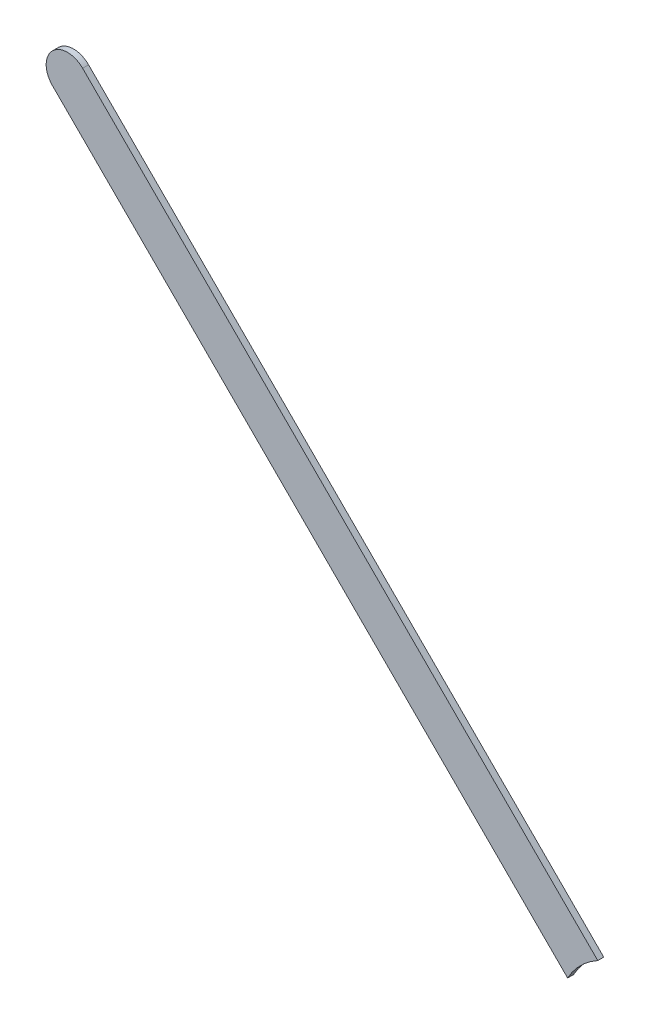
ISO-10303-21;
HEADER;
FILE_DESCRIPTION(('STEP AP214'),'2;1');
FILE_NAME('part.step','',(''),(''),'','','');
FILE_SCHEMA(('AUTOMOTIVE_DESIGN { 1 0 10303 214 1 1 1 1 }'));
ENDSEC;
DATA;
#1=APPLICATION_CONTEXT('core data for automotive mechanical design processes');
#2=APPLICATION_PROTOCOL_DEFINITION('international standard','automotive_design',2000,#1);
#3=PRODUCT_CONTEXT('',#1,'mechanical');
#4=PRODUCT('Part','Part','',(#3));
#5=PRODUCT_RELATED_PRODUCT_CATEGORY('part','',(#4));
#6=PRODUCT_DEFINITION_FORMATION('','',#4);
#7=PRODUCT_DEFINITION_CONTEXT('part definition',#1,'design');
#8=PRODUCT_DEFINITION('design','',#6,#7);
#9=PRODUCT_DEFINITION_SHAPE('','',#8);
#10=(LENGTH_UNIT() NAMED_UNIT(*) SI_UNIT(.MILLI.,.METRE.));
#11=(NAMED_UNIT(*) PLANE_ANGLE_UNIT() SI_UNIT($,.RADIAN.));
#12=(NAMED_UNIT(*) SI_UNIT($,.STERADIAN.) SOLID_ANGLE_UNIT());
#13=UNCERTAINTY_MEASURE_WITH_UNIT(LENGTH_MEASURE(1.E-05),#10,'distance_accuracy_value','');
#14=(GEOMETRIC_REPRESENTATION_CONTEXT(3) GLOBAL_UNCERTAINTY_ASSIGNED_CONTEXT((#13)) GLOBAL_UNIT_ASSIGNED_CONTEXT((#10,
#11,#12)) REPRESENTATION_CONTEXT('',''));
#15=CARTESIAN_POINT('',(0.,0.,0.));
#16=DIRECTION('',(0.,0.,1.));
#17=DIRECTION('',(1.,0.,0.));
#18=AXIS2_PLACEMENT_3D('',#15,#16,#17);
#19=CARTESIAN_POINT('',(85.4271723,95.85823856,0.));
#20=DIRECTION('',(0.707106781186548,0.707106781186548,0.));
#21=DIRECTION('',(0.707106781186548,-0.707106781186548,0.));
#22=AXIS2_PLACEMENT_3D('',#19,#20,#21);
#23=PLANE('',#22);
#24=DIRECTION('',(0.707106781186548,-0.707106781186548,0.));
#25=VECTOR('',#24,1.);
#26=CARTESIAN_POINT('',(85.4271723,95.85823856,0.03556));
#27=LINE('',#26,#25);
#28=CARTESIAN_POINT('',(85.4271723,95.85823856,0.03556));
#29=VERTEX_POINT('',#28);
#30=CARTESIAN_POINT('',(88.4959432122599,92.7894676477401,0.03556));
#31=VERTEX_POINT('',#30);
#32=EDGE_CURVE('E11',#29,#31,#27,.T.);
#33=ORIENTED_EDGE('',*,*,#32,.F.);
#34=DIRECTION('',(0.,0.,1.));
#35=VECTOR('',#34,1.);
#36=CARTESIAN_POINT('',(85.4271723,95.85823856,0.));
#37=LINE('',#36,#35);
#38=CARTESIAN_POINT('',(85.4271723,95.85823856,0.));
#39=VERTEX_POINT('',#38);
#40=EDGE_CURVE('E24',#39,#29,#37,.T.);
#41=ORIENTED_EDGE('',*,*,#40,.F.);
#42=DIRECTION('',(0.707106781186548,-0.707106781186548,0.));
#43=VECTOR('',#42,1.);
#44=CARTESIAN_POINT('',(85.4271723,95.85823856,0.));
#45=LINE('',#44,#43);
#46=CARTESIAN_POINT('',(88.4959432122599,92.7894676477401,0.));
#47=VERTEX_POINT('',#46);
#48=EDGE_CURVE('E75',#39,#47,#45,.T.);
#49=ORIENTED_EDGE('',*,*,#48,.T.);
#50=DIRECTION('',(0.,0.,1.));
#51=VECTOR('',#50,1.);
#52=CARTESIAN_POINT('',(88.4959432122599,92.7894676477401,0.));
#53=LINE('',#52,#51);
#54=EDGE_CURVE('E37',#47,#31,#53,.T.);
#55=ORIENTED_EDGE('',*,*,#54,.T.);
#56=EDGE_LOOP('',(#33,#41,#49,#55));
#57=FACE_BOUND('',#56,.T.);
#58=ADVANCED_FACE('F17',(#57),#23,.F.);
#59=CARTESIAN_POINT('',(88.8910084,92.5740084,0.));
#60=DIRECTION('',(0.,0.,-1.));
#61=DIRECTION('',(1.,0.,0.));
#62=AXIS2_PLACEMENT_3D('',#59,#60,#61);
#63=CYLINDRICAL_SURFACE('',#62,0.4499991);
#64=DIRECTION('',(0.,0.,1.));
#65=VECTOR('',#64,1.);
#66=CARTESIAN_POINT('',(88.6755491522599,92.9690735877401,0.));
#67=LINE('',#66,#65);
#68=CARTESIAN_POINT('',(88.6755491522599,92.9690735877401,0.));
#69=VERTEX_POINT('',#68);
#70=CARTESIAN_POINT('',(88.6755491522599,92.9690735877401,0.03556));
#71=VERTEX_POINT('',#70);
#72=EDGE_CURVE('E67',#69,#71,#67,.T.);
#73=ORIENTED_EDGE('',*,*,#72,.T.);
#74=CARTESIAN_POINT('',(88.8910084,92.5740084,0.03556));
#75=DIRECTION('',(0.,0.,1.));
#76=DIRECTION('',(1.,0.,0.));
#77=AXIS2_PLACEMENT_3D('',#74,#75,#76);
#78=CIRCLE('',#77,0.4499991);
#79=EDGE_CURVE('E82',#71,#31,#78,.T.);
#80=ORIENTED_EDGE('',*,*,#79,.T.);
#81=ORIENTED_EDGE('',*,*,#54,.F.);
#82=CARTESIAN_POINT('',(88.8910084,92.5740084,0.));
#83=DIRECTION('',(0.,0.,1.));
#84=DIRECTION('',(1.,0.,0.));
#85=AXIS2_PLACEMENT_3D('',#82,#83,#84);
#86=CIRCLE('',#85,0.4499991);
#87=EDGE_CURVE('E80',#69,#47,#86,.T.);
#88=ORIENTED_EDGE('',*,*,#87,.F.);
#89=EDGE_LOOP('',(#73,#80,#81,#88));
#90=FACE_BOUND('',#89,.T.);
#91=ADVANCED_FACE('F88',(#90),#63,.F.);
#92=CARTESIAN_POINT('',(88.6755491522599,92.9690735877401,0.));
#93=DIRECTION('',(-0.707106781186549,-0.707106781186546,0.));
#94=DIRECTION('',(-0.707106781186546,0.707106781186549,0.));
#95=AXIS2_PLACEMENT_3D('',#92,#93,#94);
#96=PLANE('',#95);
#97=DIRECTION('',(-0.707106781186546,0.707106781186549,0.));
#98=VECTOR('',#97,1.);
#99=CARTESIAN_POINT('',(88.9808101,92.66381264,0.03556));
#100=LINE('',#99,#98);
#101=CARTESIAN_POINT('',(85.60677824,96.0378445,0.03556));
#102=VERTEX_POINT('',#101);
#103=EDGE_CURVE('E71',#71,#102,#100,.T.);
#104=ORIENTED_EDGE('',*,*,#103,.F.);
#105=ORIENTED_EDGE('',*,*,#72,.F.);
#106=DIRECTION('',(-0.707106781186546,0.707106781186549,0.));
#107=VECTOR('',#106,1.);
#108=CARTESIAN_POINT('',(88.9808101,92.66381264,0.));
#109=LINE('',#108,#107);
#110=CARTESIAN_POINT('',(85.60677824,96.0378445,0.));
#111=VERTEX_POINT('',#110);
#112=EDGE_CURVE('E63',#69,#111,#109,.T.);
#113=ORIENTED_EDGE('',*,*,#112,.T.);
#114=DIRECTION('',(0.,0.,1.));
#115=VECTOR('',#114,1.);
#116=CARTESIAN_POINT('',(85.60677824,96.0378445,0.));
#117=LINE('',#116,#115);
#118=EDGE_CURVE('E53',#111,#102,#117,.T.);
#119=ORIENTED_EDGE('',*,*,#118,.T.);
#120=EDGE_LOOP('',(#104,#105,#113,#119));
#121=FACE_BOUND('',#120,.T.);
#122=ADVANCED_FACE('F66',(#121),#96,.F.);
#123=CARTESIAN_POINT('',(85.51697527,95.94804153,0.));
#124=DIRECTION('',(0.,0.,-1.));
#125=DIRECTION('',(0.707106781186548,0.707106781186548,0.));
#126=AXIS2_PLACEMENT_3D('',#123,#124,#125);
#127=CYLINDRICAL_SURFACE('',#126,0.127000578115386);
#128=CARTESIAN_POINT('',(85.51697527,95.94804153,0.03556));
#129=DIRECTION('',(0.,0.,1.));
#130=DIRECTION('',(0.707106781186548,0.707106781186548,0.));
#131=AXIS2_PLACEMENT_3D('',#128,#129,#130);
#132=CIRCLE('',#131,0.127000578115386);
#133=EDGE_CURVE('E59',#102,#29,#132,.T.);
#134=ORIENTED_EDGE('',*,*,#133,.F.);
#135=ORIENTED_EDGE('',*,*,#118,.F.);
#136=CARTESIAN_POINT('',(85.51697527,95.94804153,0.));
#137=DIRECTION('',(0.,0.,1.));
#138=DIRECTION('',(0.707106781186548,0.707106781186548,0.));
#139=AXIS2_PLACEMENT_3D('',#136,#137,#138);
#140=CIRCLE('',#139,0.127000578115386);
#141=EDGE_CURVE('E57',#111,#39,#140,.T.);
#142=ORIENTED_EDGE('',*,*,#141,.T.);
#143=ORIENTED_EDGE('',*,*,#40,.T.);
#144=EDGE_LOOP('',(#134,#135,#142,#143));
#145=FACE_BOUND('',#144,.T.);
#146=ADVANCED_FACE('F55',(#145),#127,.T.);
#147=CARTESIAN_POINT('',(85.4271723,95.85823856,0.));
#148=DIRECTION('',(0.,0.,-1.));
#149=DIRECTION('',(-1.,0.,0.));
#150=AXIS2_PLACEMENT_3D('',#147,#148,#149);
#151=PLANE('',#150);
#152=ORIENTED_EDGE('',*,*,#48,.F.);
#153=ORIENTED_EDGE('',*,*,#141,.F.);
#154=ORIENTED_EDGE('',*,*,#112,.F.);
#155=ORIENTED_EDGE('',*,*,#87,.T.);
#156=EDGE_LOOP('',(#152,#153,#154,#155));
#157=FACE_BOUND('',#156,.T.);
#158=ADVANCED_FACE('F74',(#157),#151,.T.);
#159=CARTESIAN_POINT('',(85.4271723,95.85823856,0.03556));
#160=DIRECTION('',(0.,0.,-1.));
#161=DIRECTION('',(-1.,0.,0.));
#162=AXIS2_PLACEMENT_3D('',#159,#160,#161);
#163=PLANE('',#162);
#164=ORIENTED_EDGE('',*,*,#133,.T.);
#165=ORIENTED_EDGE('',*,*,#32,.T.);
#166=ORIENTED_EDGE('',*,*,#79,.F.);
#167=ORIENTED_EDGE('',*,*,#103,.T.);
#168=EDGE_LOOP('',(#164,#165,#166,#167));
#169=FACE_BOUND('',#168,.T.);
#170=ADVANCED_FACE('F91',(#169),#163,.F.);
#171=CLOSED_SHELL('',(#58,#91,#122,#146,#158,#170));
#172=MANIFOLD_SOLID_BREP('B1',#171);
#173=ADVANCED_BREP_SHAPE_REPRESENTATION('',(#18,#172),#14);
#174=SHAPE_DEFINITION_REPRESENTATION(#9,#173);
ENDSEC;
END-ISO-10303-21;
